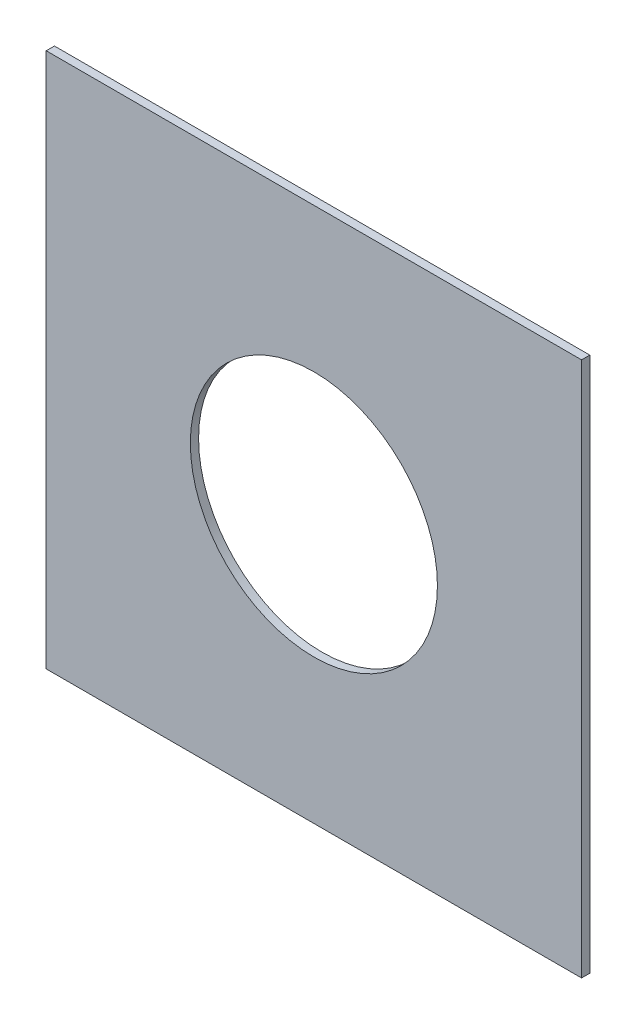
ISO-10303-21;
HEADER;
FILE_DESCRIPTION(('STEP AP214'),'2;1');
FILE_NAME('part.step','',(''),(''),'','','');
FILE_SCHEMA(('AUTOMOTIVE_DESIGN { 1 0 10303 214 1 1 1 1 }'));
ENDSEC;
DATA;
#1=APPLICATION_CONTEXT('core data for automotive mechanical design processes');
#2=APPLICATION_PROTOCOL_DEFINITION('international standard','automotive_design',2000,#1);
#3=PRODUCT_CONTEXT('',#1,'mechanical');
#4=PRODUCT('Part','Part','',(#3));
#5=PRODUCT_RELATED_PRODUCT_CATEGORY('part','',(#4));
#6=PRODUCT_DEFINITION_FORMATION('','',#4);
#7=PRODUCT_DEFINITION_CONTEXT('part definition',#1,'design');
#8=PRODUCT_DEFINITION('design','',#6,#7);
#9=PRODUCT_DEFINITION_SHAPE('','',#8);
#10=(LENGTH_UNIT() NAMED_UNIT(*) SI_UNIT(.MILLI.,.METRE.));
#11=(NAMED_UNIT(*) PLANE_ANGLE_UNIT() SI_UNIT($,.RADIAN.));
#12=(NAMED_UNIT(*) SI_UNIT($,.STERADIAN.) SOLID_ANGLE_UNIT());
#13=UNCERTAINTY_MEASURE_WITH_UNIT(LENGTH_MEASURE(1.E-05),#10,'distance_accuracy_value','');
#14=(GEOMETRIC_REPRESENTATION_CONTEXT(3) GLOBAL_UNCERTAINTY_ASSIGNED_CONTEXT((#13)) GLOBAL_UNIT_ASSIGNED_CONTEXT((#10,
#11,#12)) REPRESENTATION_CONTEXT('',''));
#15=CARTESIAN_POINT('',(0.,0.,0.));
#16=DIRECTION('',(0.,0.,1.));
#17=DIRECTION('',(1.,0.,0.));
#18=AXIS2_PLACEMENT_3D('',#15,#16,#17);
#19=CARTESIAN_POINT('',(-4.326,4.85,-6.999));
#20=DIRECTION('',(0.,1.,0.));
#21=DIRECTION('',(1.,0.,0.));
#22=AXIS2_PLACEMENT_3D('',#19,#20,#21);
#23=PLANE('',#22);
#24=DIRECTION('',(0.,0.,1.));
#25=VECTOR('',#24,1.);
#26=CARTESIAN_POINT('',(-3.025,4.85,-7.01));
#27=LINE('',#26,#25);
#28=CARTESIAN_POINT('',(-3.025,4.85,-7.02));
#29=VERTEX_POINT('',#28);
#30=CARTESIAN_POINT('',(-3.025,4.85,-7.));
#31=VERTEX_POINT('',#30);
#32=EDGE_CURVE('E62',#29,#31,#27,.T.);
#33=ORIENTED_EDGE('',*,*,#32,.F.);
#34=DIRECTION('',(1.,0.,0.));
#35=VECTOR('',#34,1.);
#36=CARTESIAN_POINT('',(-3.675,4.85,-7.02));
#37=LINE('',#36,#35);
#38=CARTESIAN_POINT('',(-4.325,4.85,-7.02));
#39=VERTEX_POINT('',#38);
#40=EDGE_CURVE('E87',#39,#29,#37,.T.);
#41=ORIENTED_EDGE('',*,*,#40,.F.);
#42=DIRECTION('',(0.,0.,-1.));
#43=VECTOR('',#42,1.);
#44=CARTESIAN_POINT('',(-4.325,4.85,-7.01));
#45=LINE('',#44,#43);
#46=CARTESIAN_POINT('',(-4.325,4.85,-7.));
#47=VERTEX_POINT('',#46);
#48=EDGE_CURVE('E73',#47,#39,#45,.T.);
#49=ORIENTED_EDGE('',*,*,#48,.F.);
#50=DIRECTION('',(-1.,0.,0.));
#51=VECTOR('',#50,1.);
#52=CARTESIAN_POINT('',(-3.675,4.85,-7.));
#53=LINE('',#52,#51);
#54=EDGE_CURVE('E56',#31,#47,#53,.T.);
#55=ORIENTED_EDGE('',*,*,#54,.F.);
#56=EDGE_LOOP('',(#33,#41,#49,#55));
#57=FACE_BOUND('',#56,.T.);
#58=ADVANCED_FACE('F17',(#57),#23,.T.);
#59=CARTESIAN_POINT('',(-3.025,4.851,-6.999));
#60=DIRECTION('',(1.,0.,0.));
#61=DIRECTION('',(0.,-1.,0.));
#62=AXIS2_PLACEMENT_3D('',#59,#60,#61);
#63=PLANE('',#62);
#64=DIRECTION('',(0.,0.,-1.));
#65=VECTOR('',#64,1.);
#66=CARTESIAN_POINT('',(-3.025,3.55,-7.01));
#67=LINE('',#66,#65);
#68=CARTESIAN_POINT('',(-3.025,3.55,-7.));
#69=VERTEX_POINT('',#68);
#70=CARTESIAN_POINT('',(-3.025,3.55,-7.02));
#71=VERTEX_POINT('',#70);
#72=EDGE_CURVE('E71',#69,#71,#67,.T.);
#73=ORIENTED_EDGE('',*,*,#72,.T.);
#74=DIRECTION('',(0.,-1.,0.));
#75=VECTOR('',#74,1.);
#76=CARTESIAN_POINT('',(-3.025,4.2,-7.02));
#77=LINE('',#76,#75);
#78=EDGE_CURVE('E67',#29,#71,#77,.T.);
#79=ORIENTED_EDGE('',*,*,#78,.F.);
#80=ORIENTED_EDGE('',*,*,#32,.T.);
#81=DIRECTION('',(0.,1.,0.));
#82=VECTOR('',#81,1.);
#83=CARTESIAN_POINT('',(-3.025,4.2,-7.));
#84=LINE('',#83,#82);
#85=EDGE_CURVE('E64',#69,#31,#84,.T.);
#86=ORIENTED_EDGE('',*,*,#85,.F.);
#87=EDGE_LOOP('',(#73,#79,#80,#86));
#88=FACE_BOUND('',#87,.T.);
#89=ADVANCED_FACE('F63',(#88),#63,.T.);
#90=CARTESIAN_POINT('',(-3.675,4.2,-7.));
#91=DIRECTION('',(0.,0.,-1.));
#92=DIRECTION('',(-1.,0.,0.));
#93=AXIS2_PLACEMENT_3D('',#90,#91,#92);
#94=CYLINDRICAL_SURFACE('',#93,0.3);
#95=CARTESIAN_POINT('',(-3.675,4.2,-7.02));
#96=DIRECTION('',(0.,0.,-1.));
#97=DIRECTION('',(-1.,0.,0.));
#98=AXIS2_PLACEMENT_3D('',#95,#96,#97);
#99=CIRCLE('',#98,0.3);
#100=CARTESIAN_POINT('',(-3.975,4.2,-7.02));
#101=VERTEX_POINT('',#100);
#102=EDGE_CURVE('E82',#101,#101,#99,.F.);
#103=ORIENTED_EDGE('',*,*,#102,.F.);
#104=EDGE_LOOP('',(#103));
#105=FACE_BOUND('',#104,.T.);
#106=CARTESIAN_POINT('',(-3.675,4.2,-7.));
#107=DIRECTION('',(0.,0.,-1.));
#108=DIRECTION('',(-1.,0.,0.));
#109=AXIS2_PLACEMENT_3D('',#106,#107,#108);
#110=CIRCLE('',#109,0.3);
#111=CARTESIAN_POINT('',(-3.975,4.2,-7.));
#112=VERTEX_POINT('',#111);
#113=EDGE_CURVE('E21',#112,#112,#110,.T.);
#114=ORIENTED_EDGE('',*,*,#113,.F.);
#115=EDGE_LOOP('',(#114));
#116=FACE_BOUND('',#115,.T.);
#117=ADVANCED_FACE('F99',(#105,#116),#94,.F.);
#118=CARTESIAN_POINT('',(-3.024,4.851,-7.));
#119=DIRECTION('',(0.,0.,1.));
#120=DIRECTION('',(-1.,0.,0.));
#121=AXIS2_PLACEMENT_3D('',#118,#119,#120);
#122=PLANE('',#121);
#123=ORIENTED_EDGE('',*,*,#113,.T.);
#124=EDGE_LOOP('',(#123));
#125=FACE_BOUND('',#124,.T.);
#126=DIRECTION('',(0.,1.,0.));
#127=VECTOR('',#126,1.);
#128=CARTESIAN_POINT('',(-4.325,4.2,-7.));
#129=LINE('',#128,#127);
#130=CARTESIAN_POINT('',(-4.325,3.55,-7.));
#131=VERTEX_POINT('',#130);
#132=EDGE_CURVE('E94',#131,#47,#129,.T.);
#133=ORIENTED_EDGE('',*,*,#132,.F.);
#134=DIRECTION('',(-1.,0.,0.));
#135=VECTOR('',#134,1.);
#136=CARTESIAN_POINT('',(-3.675,3.55,-7.));
#137=LINE('',#136,#135);
#138=EDGE_CURVE('E78',#69,#131,#137,.T.);
#139=ORIENTED_EDGE('',*,*,#138,.F.);
#140=ORIENTED_EDGE('',*,*,#85,.T.);
#141=ORIENTED_EDGE('',*,*,#54,.T.);
#142=EDGE_LOOP('',(#133,#139,#140,#141));
#143=FACE_BOUND('',#142,.T.);
#144=ADVANCED_FACE('F76',(#125,#143),#122,.T.);
#145=CARTESIAN_POINT('',(-4.325,3.549,-6.999));
#146=DIRECTION('',(-1.,0.,0.));
#147=DIRECTION('',(0.,1.,0.));
#148=AXIS2_PLACEMENT_3D('',#145,#146,#147);
#149=PLANE('',#148);
#150=ORIENTED_EDGE('',*,*,#48,.T.);
#151=DIRECTION('',(0.,1.,0.));
#152=VECTOR('',#151,1.);
#153=CARTESIAN_POINT('',(-4.325,4.2,-7.02));
#154=LINE('',#153,#152);
#155=CARTESIAN_POINT('',(-4.325,3.55,-7.02));
#156=VERTEX_POINT('',#155);
#157=EDGE_CURVE('E36',#156,#39,#154,.T.);
#158=ORIENTED_EDGE('',*,*,#157,.F.);
#159=DIRECTION('',(0.,0.,-1.));
#160=VECTOR('',#159,1.);
#161=CARTESIAN_POINT('',(-4.325,3.55,-7.01));
#162=LINE('',#161,#160);
#163=EDGE_CURVE('E27',#131,#156,#162,.T.);
#164=ORIENTED_EDGE('',*,*,#163,.F.);
#165=ORIENTED_EDGE('',*,*,#132,.T.);
#166=EDGE_LOOP('',(#150,#158,#164,#165));
#167=FACE_BOUND('',#166,.T.);
#168=ADVANCED_FACE('F108',(#167),#149,.T.);
#169=CARTESIAN_POINT('',(-4.326,4.851,-7.02));
#170=DIRECTION('',(0.,0.,-1.));
#171=DIRECTION('',(1.,0.,0.));
#172=AXIS2_PLACEMENT_3D('',#169,#170,#171);
#173=PLANE('',#172);
#174=ORIENTED_EDGE('',*,*,#102,.T.);
#175=EDGE_LOOP('',(#174));
#176=FACE_BOUND('',#175,.T.);
#177=ORIENTED_EDGE('',*,*,#40,.T.);
#178=ORIENTED_EDGE('',*,*,#78,.T.);
#179=DIRECTION('',(1.,0.,0.));
#180=VECTOR('',#179,1.);
#181=CARTESIAN_POINT('',(-3.675,3.55,-7.02));
#182=LINE('',#181,#180);
#183=EDGE_CURVE('E11',#156,#71,#182,.T.);
#184=ORIENTED_EDGE('',*,*,#183,.F.);
#185=ORIENTED_EDGE('',*,*,#157,.T.);
#186=EDGE_LOOP('',(#177,#178,#184,#185));
#187=FACE_BOUND('',#186,.T.);
#188=ADVANCED_FACE('F112',(#176,#187),#173,.T.);
#189=CARTESIAN_POINT('',(-3.024,3.55,-6.999));
#190=DIRECTION('',(0.,-1.,0.));
#191=DIRECTION('',(-1.,0.,0.));
#192=AXIS2_PLACEMENT_3D('',#189,#190,#191);
#193=PLANE('',#192);
#194=ORIENTED_EDGE('',*,*,#163,.T.);
#195=ORIENTED_EDGE('',*,*,#183,.T.);
#196=ORIENTED_EDGE('',*,*,#72,.F.);
#197=ORIENTED_EDGE('',*,*,#138,.T.);
#198=EDGE_LOOP('',(#194,#195,#196,#197));
#199=FACE_BOUND('',#198,.T.);
#200=ADVANCED_FACE('F19',(#199),#193,.T.);
#201=CLOSED_SHELL('',(#58,#89,#117,#144,#168,#188,#200));
#202=MANIFOLD_SOLID_BREP('B1',#201);
#203=ADVANCED_BREP_SHAPE_REPRESENTATION('',(#18,#202),#14);
#204=SHAPE_DEFINITION_REPRESENTATION(#9,#203);
ENDSEC;
END-ISO-10303-21;
